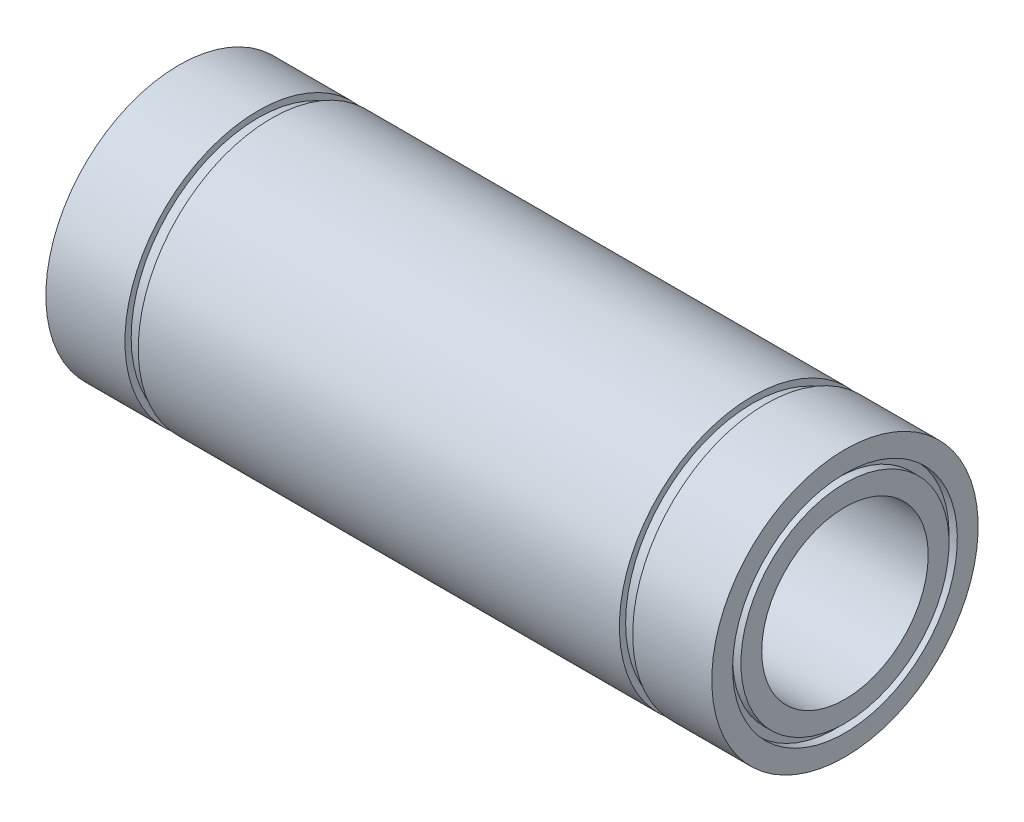
ISO-10303-21;
HEADER;
FILE_DESCRIPTION(('STEP AP214'),'2;1');
FILE_NAME('part.step','',(''),(''),'','','');
FILE_SCHEMA(('AUTOMOTIVE_DESIGN { 1 0 10303 214 1 1 1 1 }'));
ENDSEC;
DATA;
#1=APPLICATION_CONTEXT('core data for automotive mechanical design processes');
#2=APPLICATION_PROTOCOL_DEFINITION('international standard','automotive_design',2000,#1);
#3=PRODUCT_CONTEXT('',#1,'mechanical');
#4=PRODUCT('Part','Part','',(#3));
#5=PRODUCT_RELATED_PRODUCT_CATEGORY('part','',(#4));
#6=PRODUCT_DEFINITION_FORMATION('','',#4);
#7=PRODUCT_DEFINITION_CONTEXT('part definition',#1,'design');
#8=PRODUCT_DEFINITION('design','',#6,#7);
#9=PRODUCT_DEFINITION_SHAPE('','',#8);
#10=(LENGTH_UNIT() NAMED_UNIT(*) SI_UNIT(.MILLI.,.METRE.));
#11=(NAMED_UNIT(*) PLANE_ANGLE_UNIT() SI_UNIT($,.RADIAN.));
#12=(NAMED_UNIT(*) SI_UNIT($,.STERADIAN.) SOLID_ANGLE_UNIT());
#13=UNCERTAINTY_MEASURE_WITH_UNIT(LENGTH_MEASURE(1.E-05),#10,'distance_accuracy_value','');
#14=(GEOMETRIC_REPRESENTATION_CONTEXT(3) GLOBAL_UNCERTAINTY_ASSIGNED_CONTEXT((#13)) GLOBAL_UNIT_ASSIGNED_CONTEXT((#10,
#11,#12)) REPRESENTATION_CONTEXT('',''));
#15=CARTESIAN_POINT('',(0.,0.,0.));
#16=DIRECTION('',(0.,0.,1.));
#17=DIRECTION('',(1.,0.,0.));
#18=AXIS2_PLACEMENT_3D('',#15,#16,#17);
#19=CARTESIAN_POINT('',(-40.,13.5,0.));
#20=DIRECTION('',(-1.,0.,0.));
#21=DIRECTION('',(0.,-1.,0.));
#22=AXIS2_PLACEMENT_3D('',#19,#20,#21);
#23=PLANE('',#22);
#24=CARTESIAN_POINT('',(-40.,0.,0.));
#25=DIRECTION('',(1.,0.,0.));
#26=DIRECTION('',(0.,1.,0.));
#27=AXIS2_PLACEMENT_3D('',#24,#25,#26);
#28=CIRCLE('',#27,13.5);
#29=CARTESIAN_POINT('',(-40.,13.5,0.));
#30=VERTEX_POINT('',#29);
#31=EDGE_CURVE('E125',#30,#30,#28,.T.);
#32=ORIENTED_EDGE('',*,*,#31,.T.);
#33=EDGE_LOOP('',(#32));
#34=FACE_BOUND('',#33,.T.);
#35=CARTESIAN_POINT('',(-40.,0.,0.));
#36=DIRECTION('',(1.,0.,0.));
#37=DIRECTION('',(0.,1.,0.));
#38=AXIS2_PLACEMENT_3D('',#35,#36,#37);
#39=CIRCLE('',#38,16.);
#40=CARTESIAN_POINT('',(-40.,16.,0.));
#41=VERTEX_POINT('',#40);
#42=EDGE_CURVE('E10',#41,#41,#39,.T.);
#43=ORIENTED_EDGE('',*,*,#42,.F.);
#44=EDGE_LOOP('',(#43));
#45=FACE_BOUND('',#44,.T.);
#46=ADVANCED_FACE('F42',(#34,#45),#23,.T.);
#47=CARTESIAN_POINT('',(0.,0.,0.));
#48=DIRECTION('',(1.,0.,0.));
#49=DIRECTION('',(0.,1.,0.));
#50=AXIS2_PLACEMENT_3D('',#47,#48,#49);
#51=CYLINDRICAL_SURFACE('',#50,16.);
#52=ORIENTED_EDGE('',*,*,#42,.T.);
#53=EDGE_LOOP('',(#52));
#54=FACE_BOUND('',#53,.T.);
#55=CARTESIAN_POINT('',(-30.5,0.,0.));
#56=DIRECTION('',(1.,0.,0.));
#57=DIRECTION('',(0.,1.,0.));
#58=AXIS2_PLACEMENT_3D('',#55,#56,#57);
#59=CIRCLE('',#58,16.);
#60=CARTESIAN_POINT('',(-30.5,16.,0.));
#61=VERTEX_POINT('',#60);
#62=EDGE_CURVE('E49',#61,#61,#59,.T.);
#63=ORIENTED_EDGE('',*,*,#62,.F.);
#64=EDGE_LOOP('',(#63));
#65=FACE_BOUND('',#64,.T.);
#66=ADVANCED_FACE('F144',(#54,#65),#51,.T.);
#67=CARTESIAN_POINT('',(-30.5,16.,0.));
#68=DIRECTION('',(1.,0.,0.));
#69=DIRECTION('',(0.,1.,0.));
#70=AXIS2_PLACEMENT_3D('',#67,#68,#69);
#71=PLANE('',#70);
#72=ORIENTED_EDGE('',*,*,#62,.T.);
#73=EDGE_LOOP('',(#72));
#74=FACE_BOUND('',#73,.T.);
#75=CARTESIAN_POINT('',(-30.5,0.,0.));
#76=DIRECTION('',(1.,0.,0.));
#77=DIRECTION('',(0.,1.,0.));
#78=AXIS2_PLACEMENT_3D('',#75,#76,#77);
#79=CIRCLE('',#78,15.25);
#80=CARTESIAN_POINT('',(-30.5,15.25,0.));
#81=VERTEX_POINT('',#80);
#82=EDGE_CURVE('E56',#81,#81,#79,.T.);
#83=ORIENTED_EDGE('',*,*,#82,.F.);
#84=EDGE_LOOP('',(#83));
#85=FACE_BOUND('',#84,.T.);
#86=ADVANCED_FACE('F148',(#74,#85),#71,.T.);
#87=CARTESIAN_POINT('',(0.,0.,0.));
#88=DIRECTION('',(1.,0.,0.));
#89=DIRECTION('',(0.,1.,0.));
#90=AXIS2_PLACEMENT_3D('',#87,#88,#89);
#91=CYLINDRICAL_SURFACE('',#90,15.25);
#92=ORIENTED_EDGE('',*,*,#82,.T.);
#93=EDGE_LOOP('',(#92));
#94=FACE_BOUND('',#93,.T.);
#95=CARTESIAN_POINT('',(-28.9,0.,0.));
#96=DIRECTION('',(1.,0.,0.));
#97=DIRECTION('',(0.,1.,0.));
#98=AXIS2_PLACEMENT_3D('',#95,#96,#97);
#99=CIRCLE('',#98,15.25);
#100=CARTESIAN_POINT('',(-28.9,15.25,0.));
#101=VERTEX_POINT('',#100);
#102=EDGE_CURVE('E63',#101,#101,#99,.T.);
#103=ORIENTED_EDGE('',*,*,#102,.F.);
#104=EDGE_LOOP('',(#103));
#105=FACE_BOUND('',#104,.T.);
#106=ADVANCED_FACE('F152',(#94,#105),#91,.T.);
#107=CARTESIAN_POINT('',(-28.9,15.25,0.));
#108=DIRECTION('',(-1.,0.,0.));
#109=DIRECTION('',(0.,-1.,0.));
#110=AXIS2_PLACEMENT_3D('',#107,#108,#109);
#111=PLANE('',#110);
#112=ORIENTED_EDGE('',*,*,#102,.T.);
#113=EDGE_LOOP('',(#112));
#114=FACE_BOUND('',#113,.T.);
#115=CARTESIAN_POINT('',(-28.9,0.,0.));
#116=DIRECTION('',(1.,0.,0.));
#117=DIRECTION('',(0.,1.,0.));
#118=AXIS2_PLACEMENT_3D('',#115,#116,#117);
#119=CIRCLE('',#118,16.);
#120=CARTESIAN_POINT('',(-28.9,16.,0.));
#121=VERTEX_POINT('',#120);
#122=EDGE_CURVE('E69',#121,#121,#119,.T.);
#123=ORIENTED_EDGE('',*,*,#122,.F.);
#124=EDGE_LOOP('',(#123));
#125=FACE_BOUND('',#124,.T.);
#126=ADVANCED_FACE('F158',(#114,#125),#111,.T.);
#127=CARTESIAN_POINT('',(0.,0.,0.));
#128=DIRECTION('',(1.,0.,0.));
#129=DIRECTION('',(0.,1.,0.));
#130=AXIS2_PLACEMENT_3D('',#127,#128,#129);
#131=CYLINDRICAL_SURFACE('',#130,16.);
#132=ORIENTED_EDGE('',*,*,#122,.T.);
#133=EDGE_LOOP('',(#132));
#134=FACE_BOUND('',#133,.T.);
#135=CARTESIAN_POINT('',(28.9,0.,0.));
#136=DIRECTION('',(1.,0.,0.));
#137=DIRECTION('',(0.,1.,0.));
#138=AXIS2_PLACEMENT_3D('',#135,#136,#137);
#139=CIRCLE('',#138,16.);
#140=CARTESIAN_POINT('',(28.9,16.,0.));
#141=VERTEX_POINT('',#140);
#142=EDGE_CURVE('E73',#141,#141,#139,.T.);
#143=ORIENTED_EDGE('',*,*,#142,.F.);
#144=EDGE_LOOP('',(#143));
#145=FACE_BOUND('',#144,.T.);
#146=ADVANCED_FACE('F162',(#134,#145),#131,.T.);
#147=CARTESIAN_POINT('',(28.9,16.,0.));
#148=DIRECTION('',(1.,0.,0.));
#149=DIRECTION('',(0.,1.,0.));
#150=AXIS2_PLACEMENT_3D('',#147,#148,#149);
#151=PLANE('',#150);
#152=ORIENTED_EDGE('',*,*,#142,.T.);
#153=EDGE_LOOP('',(#152));
#154=FACE_BOUND('',#153,.T.);
#155=CARTESIAN_POINT('',(28.9,0.,0.));
#156=DIRECTION('',(1.,0.,0.));
#157=DIRECTION('',(0.,1.,0.));
#158=AXIS2_PLACEMENT_3D('',#155,#156,#157);
#159=CIRCLE('',#158,15.25);
#160=CARTESIAN_POINT('',(28.9,15.25,0.));
#161=VERTEX_POINT('',#160);
#162=EDGE_CURVE('E76',#161,#161,#159,.T.);
#163=ORIENTED_EDGE('',*,*,#162,.F.);
#164=EDGE_LOOP('',(#163));
#165=FACE_BOUND('',#164,.T.);
#166=ADVANCED_FACE('F166',(#154,#165),#151,.T.);
#167=CARTESIAN_POINT('',(0.,0.,0.));
#168=DIRECTION('',(1.,0.,0.));
#169=DIRECTION('',(0.,1.,0.));
#170=AXIS2_PLACEMENT_3D('',#167,#168,#169);
#171=CYLINDRICAL_SURFACE('',#170,15.25);
#172=ORIENTED_EDGE('',*,*,#162,.T.);
#173=EDGE_LOOP('',(#172));
#174=FACE_BOUND('',#173,.T.);
#175=CARTESIAN_POINT('',(30.5,0.,0.));
#176=DIRECTION('',(1.,0.,0.));
#177=DIRECTION('',(0.,1.,0.));
#178=AXIS2_PLACEMENT_3D('',#175,#176,#177);
#179=CIRCLE('',#178,15.25);
#180=CARTESIAN_POINT('',(30.5,15.25,0.));
#181=VERTEX_POINT('',#180);
#182=EDGE_CURVE('E79',#181,#181,#179,.T.);
#183=ORIENTED_EDGE('',*,*,#182,.F.);
#184=EDGE_LOOP('',(#183));
#185=FACE_BOUND('',#184,.T.);
#186=ADVANCED_FACE('F170',(#174,#185),#171,.T.);
#187=CARTESIAN_POINT('',(30.5,15.25,0.));
#188=DIRECTION('',(-1.,0.,0.));
#189=DIRECTION('',(0.,-1.,0.));
#190=AXIS2_PLACEMENT_3D('',#187,#188,#189);
#191=PLANE('',#190);
#192=ORIENTED_EDGE('',*,*,#182,.T.);
#193=EDGE_LOOP('',(#192));
#194=FACE_BOUND('',#193,.T.);
#195=CARTESIAN_POINT('',(30.5,0.,0.));
#196=DIRECTION('',(1.,0.,0.));
#197=DIRECTION('',(0.,1.,0.));
#198=AXIS2_PLACEMENT_3D('',#195,#196,#197);
#199=CIRCLE('',#198,16.);
#200=CARTESIAN_POINT('',(30.5,16.,0.));
#201=VERTEX_POINT('',#200);
#202=EDGE_CURVE('E83',#201,#201,#199,.T.);
#203=ORIENTED_EDGE('',*,*,#202,.F.);
#204=EDGE_LOOP('',(#203));
#205=FACE_BOUND('',#204,.T.);
#206=ADVANCED_FACE('F174',(#194,#205),#191,.T.);
#207=CARTESIAN_POINT('',(0.,0.,0.));
#208=DIRECTION('',(1.,0.,0.));
#209=DIRECTION('',(0.,1.,0.));
#210=AXIS2_PLACEMENT_3D('',#207,#208,#209);
#211=CYLINDRICAL_SURFACE('',#210,16.);
#212=ORIENTED_EDGE('',*,*,#202,.T.);
#213=EDGE_LOOP('',(#212));
#214=FACE_BOUND('',#213,.T.);
#215=CARTESIAN_POINT('',(40.,0.,0.));
#216=DIRECTION('',(1.,0.,0.));
#217=DIRECTION('',(0.,1.,0.));
#218=AXIS2_PLACEMENT_3D('',#215,#216,#217);
#219=CIRCLE('',#218,16.);
#220=CARTESIAN_POINT('',(40.,16.,0.));
#221=VERTEX_POINT('',#220);
#222=EDGE_CURVE('E87',#221,#221,#219,.T.);
#223=ORIENTED_EDGE('',*,*,#222,.F.);
#224=EDGE_LOOP('',(#223));
#225=FACE_BOUND('',#224,.T.);
#226=ADVANCED_FACE('F178',(#214,#225),#211,.T.);
#227=CARTESIAN_POINT('',(40.,16.,0.));
#228=DIRECTION('',(1.,0.,0.));
#229=DIRECTION('',(0.,1.,0.));
#230=AXIS2_PLACEMENT_3D('',#227,#228,#229);
#231=PLANE('',#230);
#232=ORIENTED_EDGE('',*,*,#222,.T.);
#233=EDGE_LOOP('',(#232));
#234=FACE_BOUND('',#233,.T.);
#235=CARTESIAN_POINT('',(40.,0.,0.));
#236=DIRECTION('',(1.,0.,0.));
#237=DIRECTION('',(0.,1.,0.));
#238=AXIS2_PLACEMENT_3D('',#235,#236,#237);
#239=CIRCLE('',#238,13.5);
#240=CARTESIAN_POINT('',(40.,13.5,0.));
#241=VERTEX_POINT('',#240);
#242=EDGE_CURVE('E91',#241,#241,#239,.T.);
#243=ORIENTED_EDGE('',*,*,#242,.F.);
#244=EDGE_LOOP('',(#243));
#245=FACE_BOUND('',#244,.T.);
#246=ADVANCED_FACE('F182',(#234,#245),#231,.T.);
#247=CARTESIAN_POINT('',(0.,0.,0.));
#248=DIRECTION('',(1.,0.,0.));
#249=DIRECTION('',(0.,1.,0.));
#250=AXIS2_PLACEMENT_3D('',#247,#248,#249);
#251=CYLINDRICAL_SURFACE('',#250,13.5);
#252=ORIENTED_EDGE('',*,*,#242,.T.);
#253=EDGE_LOOP('',(#252));
#254=FACE_BOUND('',#253,.T.);
#255=CARTESIAN_POINT('',(39.,0.,0.));
#256=DIRECTION('',(1.,0.,0.));
#257=DIRECTION('',(0.,1.,0.));
#258=AXIS2_PLACEMENT_3D('',#255,#256,#257);
#259=CIRCLE('',#258,13.5);
#260=CARTESIAN_POINT('',(39.,13.5,0.));
#261=VERTEX_POINT('',#260);
#262=EDGE_CURVE('E95',#261,#261,#259,.T.);
#263=ORIENTED_EDGE('',*,*,#262,.F.);
#264=EDGE_LOOP('',(#263));
#265=FACE_BOUND('',#264,.T.);
#266=ADVANCED_FACE('F186',(#254,#265),#251,.F.);
#267=CARTESIAN_POINT('',(39.,13.5,0.));
#268=DIRECTION('',(1.,0.,0.));
#269=DIRECTION('',(0.,1.,0.));
#270=AXIS2_PLACEMENT_3D('',#267,#268,#269);
#271=PLANE('',#270);
#272=ORIENTED_EDGE('',*,*,#262,.T.);
#273=EDGE_LOOP('',(#272));
#274=FACE_BOUND('',#273,.T.);
#275=CARTESIAN_POINT('',(39.,0.,0.));
#276=DIRECTION('',(1.,0.,0.));
#277=DIRECTION('',(0.,1.,0.));
#278=AXIS2_PLACEMENT_3D('',#275,#276,#277);
#279=CIRCLE('',#278,12.5);
#280=CARTESIAN_POINT('',(39.,12.5,0.));
#281=VERTEX_POINT('',#280);
#282=EDGE_CURVE('E99',#281,#281,#279,.T.);
#283=ORIENTED_EDGE('',*,*,#282,.F.);
#284=EDGE_LOOP('',(#283));
#285=FACE_BOUND('',#284,.T.);
#286=ADVANCED_FACE('F190',(#274,#285),#271,.T.);
#287=CARTESIAN_POINT('',(0.,0.,0.));
#288=DIRECTION('',(1.,0.,0.));
#289=DIRECTION('',(0.,1.,0.));
#290=AXIS2_PLACEMENT_3D('',#287,#288,#289);
#291=CYLINDRICAL_SURFACE('',#290,12.5);
#292=ORIENTED_EDGE('',*,*,#282,.T.);
#293=EDGE_LOOP('',(#292));
#294=FACE_BOUND('',#293,.T.);
#295=CARTESIAN_POINT('',(40.,0.,0.));
#296=DIRECTION('',(1.,0.,0.));
#297=DIRECTION('',(0.,1.,0.));
#298=AXIS2_PLACEMENT_3D('',#295,#296,#297);
#299=CIRCLE('',#298,12.5);
#300=CARTESIAN_POINT('',(40.,12.5,0.));
#301=VERTEX_POINT('',#300);
#302=EDGE_CURVE('E103',#301,#301,#299,.T.);
#303=ORIENTED_EDGE('',*,*,#302,.F.);
#304=EDGE_LOOP('',(#303));
#305=FACE_BOUND('',#304,.T.);
#306=ADVANCED_FACE('F194',(#294,#305),#291,.T.);
#307=CARTESIAN_POINT('',(40.,12.5,0.));
#308=DIRECTION('',(1.,0.,0.));
#309=DIRECTION('',(0.,1.,0.));
#310=AXIS2_PLACEMENT_3D('',#307,#308,#309);
#311=PLANE('',#310);
#312=ORIENTED_EDGE('',*,*,#302,.T.);
#313=EDGE_LOOP('',(#312));
#314=FACE_BOUND('',#313,.T.);
#315=CARTESIAN_POINT('',(40.,0.,0.));
#316=DIRECTION('',(1.,0.,0.));
#317=DIRECTION('',(0.,1.,0.));
#318=AXIS2_PLACEMENT_3D('',#315,#316,#317);
#319=CIRCLE('',#318,9.99999999999999);
#320=CARTESIAN_POINT('',(40.,10.,0.));
#321=VERTEX_POINT('',#320);
#322=EDGE_CURVE('E106',#321,#321,#319,.T.);
#323=ORIENTED_EDGE('',*,*,#322,.F.);
#324=EDGE_LOOP('',(#323));
#325=FACE_BOUND('',#324,.T.);
#326=ADVANCED_FACE('F198',(#314,#325),#311,.T.);
#327=CARTESIAN_POINT('',(0.,0.,0.));
#328=DIRECTION('',(1.,0.,0.));
#329=DIRECTION('',(0.,1.,0.));
#330=AXIS2_PLACEMENT_3D('',#327,#328,#329);
#331=CYLINDRICAL_SURFACE('',#330,10.);
#332=ORIENTED_EDGE('',*,*,#322,.T.);
#333=EDGE_LOOP('',(#332));
#334=FACE_BOUND('',#333,.T.);
#335=CARTESIAN_POINT('',(-40.,0.,0.));
#336=DIRECTION('',(1.,0.,0.));
#337=DIRECTION('',(0.,1.,0.));
#338=AXIS2_PLACEMENT_3D('',#335,#336,#337);
#339=CIRCLE('',#338,10.);
#340=CARTESIAN_POINT('',(-40.,10.,0.));
#341=VERTEX_POINT('',#340);
#342=EDGE_CURVE('E110',#341,#341,#339,.T.);
#343=ORIENTED_EDGE('',*,*,#342,.F.);
#344=EDGE_LOOP('',(#343));
#345=FACE_BOUND('',#344,.T.);
#346=ADVANCED_FACE('F202',(#334,#345),#331,.F.);
#347=CARTESIAN_POINT('',(-40.,10.,0.));
#348=DIRECTION('',(-1.,0.,0.));
#349=DIRECTION('',(0.,-1.,0.));
#350=AXIS2_PLACEMENT_3D('',#347,#348,#349);
#351=PLANE('',#350);
#352=ORIENTED_EDGE('',*,*,#342,.T.);
#353=EDGE_LOOP('',(#352));
#354=FACE_BOUND('',#353,.T.);
#355=CARTESIAN_POINT('',(-40.,0.,0.));
#356=DIRECTION('',(1.,0.,0.));
#357=DIRECTION('',(0.,1.,0.));
#358=AXIS2_PLACEMENT_3D('',#355,#356,#357);
#359=CIRCLE('',#358,12.5);
#360=CARTESIAN_POINT('',(-40.,12.5,0.));
#361=VERTEX_POINT('',#360);
#362=EDGE_CURVE('E114',#361,#361,#359,.T.);
#363=ORIENTED_EDGE('',*,*,#362,.F.);
#364=EDGE_LOOP('',(#363));
#365=FACE_BOUND('',#364,.T.);
#366=ADVANCED_FACE('F206',(#354,#365),#351,.T.);
#367=CARTESIAN_POINT('',(0.,0.,0.));
#368=DIRECTION('',(1.,0.,0.));
#369=DIRECTION('',(0.,1.,0.));
#370=AXIS2_PLACEMENT_3D('',#367,#368,#369);
#371=CYLINDRICAL_SURFACE('',#370,12.5);
#372=ORIENTED_EDGE('',*,*,#362,.T.);
#373=EDGE_LOOP('',(#372));
#374=FACE_BOUND('',#373,.T.);
#375=CARTESIAN_POINT('',(-39.,0.,0.));
#376=DIRECTION('',(1.,0.,0.));
#377=DIRECTION('',(0.,1.,0.));
#378=AXIS2_PLACEMENT_3D('',#375,#376,#377);
#379=CIRCLE('',#378,12.5);
#380=CARTESIAN_POINT('',(-39.,12.5,0.));
#381=VERTEX_POINT('',#380);
#382=EDGE_CURVE('E118',#381,#381,#379,.T.);
#383=ORIENTED_EDGE('',*,*,#382,.F.);
#384=EDGE_LOOP('',(#383));
#385=FACE_BOUND('',#384,.T.);
#386=ADVANCED_FACE('F140',(#374,#385),#371,.T.);
#387=CARTESIAN_POINT('',(-39.,13.5,0.));
#388=DIRECTION('',(-1.,0.,0.));
#389=DIRECTION('',(0.,-1.,0.));
#390=AXIS2_PLACEMENT_3D('',#387,#388,#389);
#391=PLANE('',#390);
#392=ORIENTED_EDGE('',*,*,#382,.T.);
#393=EDGE_LOOP('',(#392));
#394=FACE_BOUND('',#393,.T.);
#395=CARTESIAN_POINT('',(-39.,0.,0.));
#396=DIRECTION('',(1.,0.,0.));
#397=DIRECTION('',(0.,1.,0.));
#398=AXIS2_PLACEMENT_3D('',#395,#396,#397);
#399=CIRCLE('',#398,13.5);
#400=CARTESIAN_POINT('',(-39.,13.5,0.));
#401=VERTEX_POINT('',#400);
#402=EDGE_CURVE('E122',#401,#401,#399,.T.);
#403=ORIENTED_EDGE('',*,*,#402,.F.);
#404=EDGE_LOOP('',(#403));
#405=FACE_BOUND('',#404,.T.);
#406=ADVANCED_FACE('F134',(#394,#405),#391,.T.);
#407=CARTESIAN_POINT('',(0.,0.,0.));
#408=DIRECTION('',(1.,0.,0.));
#409=DIRECTION('',(0.,1.,0.));
#410=AXIS2_PLACEMENT_3D('',#407,#408,#409);
#411=CYLINDRICAL_SURFACE('',#410,13.5);
#412=ORIENTED_EDGE('',*,*,#402,.T.);
#413=EDGE_LOOP('',(#412));
#414=FACE_BOUND('',#413,.T.);
#415=ORIENTED_EDGE('',*,*,#31,.F.);
#416=EDGE_LOOP('',(#415));
#417=FACE_BOUND('',#416,.T.);
#418=ADVANCED_FACE('F132',(#414,#417),#411,.F.);
#419=CLOSED_SHELL('',(#46,#66,#86,#106,#126,#146,#166,#186,#206,#226,#246,#266,#286,#306,#326,
#346,#366,#386,#406,#418));
#420=MANIFOLD_SOLID_BREP('B2',#419);
#421=ADVANCED_BREP_SHAPE_REPRESENTATION('',(#18,#420),#14);
#422=SHAPE_DEFINITION_REPRESENTATION(#9,#421);
ENDSEC;
END-ISO-10303-21;
